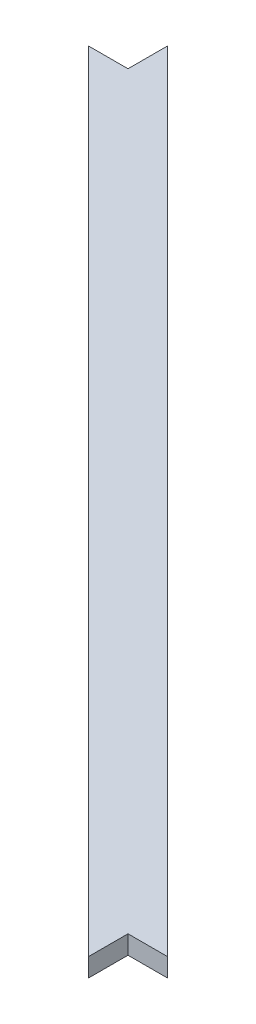
ISO-10303-21;
HEADER;
FILE_DESCRIPTION(('STEP AP214'),'2;1');
FILE_NAME('part.step','',(''),(''),'','','');
FILE_SCHEMA(('AUTOMOTIVE_DESIGN { 1 0 10303 214 1 1 1 1 }'));
ENDSEC;
DATA;
#1=APPLICATION_CONTEXT('core data for automotive mechanical design processes');
#2=APPLICATION_PROTOCOL_DEFINITION('international standard','automotive_design',2000,#1);
#3=PRODUCT_CONTEXT('',#1,'mechanical');
#4=PRODUCT('Part','Part','',(#3));
#5=PRODUCT_RELATED_PRODUCT_CATEGORY('part','',(#4));
#6=PRODUCT_DEFINITION_FORMATION('','',#4);
#7=PRODUCT_DEFINITION_CONTEXT('part definition',#1,'design');
#8=PRODUCT_DEFINITION('design','',#6,#7);
#9=PRODUCT_DEFINITION_SHAPE('','',#8);
#10=(LENGTH_UNIT() NAMED_UNIT(*) SI_UNIT(.MILLI.,.METRE.));
#11=(NAMED_UNIT(*) PLANE_ANGLE_UNIT() SI_UNIT($,.RADIAN.));
#12=(NAMED_UNIT(*) SI_UNIT($,.STERADIAN.) SOLID_ANGLE_UNIT());
#13=UNCERTAINTY_MEASURE_WITH_UNIT(LENGTH_MEASURE(1.E-05),#10,'distance_accuracy_value','');
#14=(GEOMETRIC_REPRESENTATION_CONTEXT(3) GLOBAL_UNCERTAINTY_ASSIGNED_CONTEXT((#13)) GLOBAL_UNIT_ASSIGNED_CONTEXT((#10,
#11,#12)) REPRESENTATION_CONTEXT('',''));
#15=CARTESIAN_POINT('',(0.,0.,0.));
#16=DIRECTION('',(0.,0.,1.));
#17=DIRECTION('',(1.,0.,0.));
#18=AXIS2_PLACEMENT_3D('',#15,#16,#17);
#19=CARTESIAN_POINT('',(-256.,12.7,-256.));
#20=DIRECTION('',(0.,0.,1.));
#21=DIRECTION('',(1.,0.,0.));
#22=AXIS2_PLACEMENT_3D('',#19,#20,#21);
#23=PLANE('',#22);
#24=DIRECTION('',(-1.,0.,0.));
#25=VECTOR('',#24,1.);
#26=CARTESIAN_POINT('',(-256.,0.,-256.));
#27=LINE('',#26,#25);
#28=CARTESIAN_POINT('',(-256.,0.,-256.));
#29=VERTEX_POINT('',#28);
#30=CARTESIAN_POINT('',(-282.940768363208,0.,-256.));
#31=VERTEX_POINT('',#30);
#32=EDGE_CURVE('E128',#29,#31,#27,.T.);
#33=ORIENTED_EDGE('',*,*,#32,.T.);
#34=DIRECTION('',(0.,-1.,0.));
#35=VECTOR('',#34,1.);
#36=CARTESIAN_POINT('',(-282.940768363208,12.7,-256.));
#37=LINE('',#36,#35);
#38=CARTESIAN_POINT('',(-282.940768363208,12.7,-256.));
#39=VERTEX_POINT('',#38);
#40=EDGE_CURVE('E11',#39,#31,#37,.T.);
#41=ORIENTED_EDGE('',*,*,#40,.F.);
#42=DIRECTION('',(-1.,0.,0.));
#43=VECTOR('',#42,1.);
#44=CARTESIAN_POINT('',(-256.,12.7,-256.));
#45=LINE('',#44,#43);
#46=CARTESIAN_POINT('',(-256.,12.7,-256.));
#47=VERTEX_POINT('',#46);
#48=EDGE_CURVE('E144',#47,#39,#45,.T.);
#49=ORIENTED_EDGE('',*,*,#48,.F.);
#50=DIRECTION('',(0.,-1.,0.));
#51=VECTOR('',#50,1.);
#52=CARTESIAN_POINT('',(-256.,12.7,-256.));
#53=LINE('',#52,#51);
#54=EDGE_CURVE('E124',#47,#29,#53,.T.);
#55=ORIENTED_EDGE('',*,*,#54,.T.);
#56=EDGE_LOOP('',(#33,#41,#49,#55));
#57=FACE_BOUND('',#56,.T.);
#58=ADVANCED_FACE('F39',(#57),#23,.F.);
#59=CARTESIAN_POINT('',(-282.940768363208,12.7,-256.));
#60=DIRECTION('',(0.707106781186548,0.,-0.707106781186548));
#61=DIRECTION('',(-0.707106781186548,0.,-0.707106781186548));
#62=AXIS2_PLACEMENT_3D('',#59,#60,#61);
#63=PLANE('',#62);
#64=DIRECTION('',(0.707106781186547,0.,0.707106781186547));
#65=VECTOR('',#64,1.);
#66=CARTESIAN_POINT('',(-282.940768363208,0.,-256.));
#67=LINE('',#66,#65);
#68=CARTESIAN_POINT('',(256.,0.,282.940768363208));
#69=VERTEX_POINT('',#68);
#70=EDGE_CURVE('E132',#31,#69,#67,.T.);
#71=ORIENTED_EDGE('',*,*,#70,.T.);
#72=DIRECTION('',(0.,-1.,0.));
#73=VECTOR('',#72,1.);
#74=CARTESIAN_POINT('',(256.,12.7,282.940768363208));
#75=LINE('',#74,#73);
#76=CARTESIAN_POINT('',(256.,12.7,282.940768363208));
#77=VERTEX_POINT('',#76);
#78=EDGE_CURVE('E48',#77,#69,#75,.T.);
#79=ORIENTED_EDGE('',*,*,#78,.F.);
#80=DIRECTION('',(0.707106781186547,0.,0.707106781186547));
#81=VECTOR('',#80,1.);
#82=CARTESIAN_POINT('',(-282.940768363208,12.7,-256.));
#83=LINE('',#82,#81);
#84=EDGE_CURVE('E93',#39,#77,#83,.T.);
#85=ORIENTED_EDGE('',*,*,#84,.F.);
#86=ORIENTED_EDGE('',*,*,#40,.T.);
#87=EDGE_LOOP('',(#71,#79,#85,#86));
#88=FACE_BOUND('',#87,.T.);
#89=ADVANCED_FACE('F172',(#88),#63,.F.);
#90=CARTESIAN_POINT('',(256.,12.7,282.940768363208));
#91=DIRECTION('',(-1.,0.,0.));
#92=DIRECTION('',(0.,0.,1.));
#93=AXIS2_PLACEMENT_3D('',#90,#91,#92);
#94=PLANE('',#93);
#95=DIRECTION('',(0.,0.,-1.));
#96=VECTOR('',#95,1.);
#97=CARTESIAN_POINT('',(256.,0.,282.940768363208));
#98=LINE('',#97,#96);
#99=CARTESIAN_POINT('',(256.,0.,256.));
#100=VERTEX_POINT('',#99);
#101=EDGE_CURVE('E135',#69,#100,#98,.T.);
#102=ORIENTED_EDGE('',*,*,#101,.T.);
#103=DIRECTION('',(0.,-1.,0.));
#104=VECTOR('',#103,1.);
#105=CARTESIAN_POINT('',(256.,12.7,256.));
#106=LINE('',#105,#104);
#107=CARTESIAN_POINT('',(256.,12.7,256.));
#108=VERTEX_POINT('',#107);
#109=EDGE_CURVE('E117',#108,#100,#106,.T.);
#110=ORIENTED_EDGE('',*,*,#109,.F.);
#111=DIRECTION('',(0.,0.,-1.));
#112=VECTOR('',#111,1.);
#113=CARTESIAN_POINT('',(256.,12.7,282.940768363208));
#114=LINE('',#113,#112);
#115=EDGE_CURVE('E106',#77,#108,#114,.T.);
#116=ORIENTED_EDGE('',*,*,#115,.F.);
#117=ORIENTED_EDGE('',*,*,#78,.T.);
#118=EDGE_LOOP('',(#102,#110,#116,#117));
#119=FACE_BOUND('',#118,.T.);
#120=ADVANCED_FACE('F154',(#119),#94,.F.);
#121=CARTESIAN_POINT('',(256.,12.7,256.));
#122=DIRECTION('',(0.,0.,-1.));
#123=DIRECTION('',(-1.,0.,0.));
#124=AXIS2_PLACEMENT_3D('',#121,#122,#123);
#125=PLANE('',#124);
#126=DIRECTION('',(1.,0.,0.));
#127=VECTOR('',#126,1.);
#128=CARTESIAN_POINT('',(256.,0.,256.));
#129=LINE('',#128,#127);
#130=CARTESIAN_POINT('',(282.940768363208,0.,256.));
#131=VERTEX_POINT('',#130);
#132=EDGE_CURVE('E115',#100,#131,#129,.T.);
#133=ORIENTED_EDGE('',*,*,#132,.T.);
#134=DIRECTION('',(0.,-1.,0.));
#135=VECTOR('',#134,1.);
#136=CARTESIAN_POINT('',(282.940768363208,12.7,256.));
#137=LINE('',#136,#135);
#138=CARTESIAN_POINT('',(282.940768363208,12.7,256.));
#139=VERTEX_POINT('',#138);
#140=EDGE_CURVE('E112',#139,#131,#137,.T.);
#141=ORIENTED_EDGE('',*,*,#140,.F.);
#142=DIRECTION('',(1.,0.,0.));
#143=VECTOR('',#142,1.);
#144=CARTESIAN_POINT('',(256.,12.7,256.));
#145=LINE('',#144,#143);
#146=EDGE_CURVE('E100',#108,#139,#145,.T.);
#147=ORIENTED_EDGE('',*,*,#146,.F.);
#148=ORIENTED_EDGE('',*,*,#109,.T.);
#149=EDGE_LOOP('',(#133,#141,#147,#148));
#150=FACE_BOUND('',#149,.T.);
#151=ADVANCED_FACE('F113',(#150),#125,.F.);
#152=CARTESIAN_POINT('',(282.940768363208,12.7,256.));
#153=DIRECTION('',(-0.707106781186547,0.,0.707106781186548));
#154=DIRECTION('',(0.707106781186548,0.,0.707106781186547));
#155=AXIS2_PLACEMENT_3D('',#152,#153,#154);
#156=PLANE('',#155);
#157=DIRECTION('',(-0.707106781186548,0.,-0.707106781186547));
#158=VECTOR('',#157,1.);
#159=CARTESIAN_POINT('',(282.940768363208,0.,256.));
#160=LINE('',#159,#158);
#161=CARTESIAN_POINT('',(-256.,0.,-282.940768363207));
#162=VERTEX_POINT('',#161);
#163=EDGE_CURVE('E79',#131,#162,#160,.T.);
#164=ORIENTED_EDGE('',*,*,#163,.T.);
#165=DIRECTION('',(0.,-1.,0.));
#166=VECTOR('',#165,1.);
#167=CARTESIAN_POINT('',(-256.,12.7,-282.940768363207));
#168=LINE('',#167,#166);
#169=CARTESIAN_POINT('',(-256.,12.7,-282.940768363207));
#170=VERTEX_POINT('',#169);
#171=EDGE_CURVE('E118',#170,#162,#168,.T.);
#172=ORIENTED_EDGE('',*,*,#171,.F.);
#173=DIRECTION('',(-0.707106781186548,0.,-0.707106781186547));
#174=VECTOR('',#173,1.);
#175=CARTESIAN_POINT('',(282.940768363208,12.7,256.));
#176=LINE('',#175,#174);
#177=EDGE_CURVE('E104',#139,#170,#176,.T.);
#178=ORIENTED_EDGE('',*,*,#177,.F.);
#179=ORIENTED_EDGE('',*,*,#140,.T.);
#180=EDGE_LOOP('',(#164,#172,#178,#179));
#181=FACE_BOUND('',#180,.T.);
#182=ADVANCED_FACE('F120',(#181),#156,.F.);
#183=CARTESIAN_POINT('',(-256.,12.7,-282.940768363207));
#184=DIRECTION('',(1.,0.,0.));
#185=DIRECTION('',(0.,0.,-1.));
#186=AXIS2_PLACEMENT_3D('',#183,#184,#185);
#187=PLANE('',#186);
#188=DIRECTION('',(0.,0.,1.));
#189=VECTOR('',#188,1.);
#190=CARTESIAN_POINT('',(-256.,0.,-282.940768363207));
#191=LINE('',#190,#189);
#192=EDGE_CURVE('E85',#162,#29,#191,.T.);
#193=ORIENTED_EDGE('',*,*,#192,.T.);
#194=ORIENTED_EDGE('',*,*,#54,.F.);
#195=DIRECTION('',(0.,0.,1.));
#196=VECTOR('',#195,1.);
#197=CARTESIAN_POINT('',(-256.,12.7,-282.940768363207));
#198=LINE('',#197,#196);
#199=EDGE_CURVE('E56',#170,#47,#198,.T.);
#200=ORIENTED_EDGE('',*,*,#199,.F.);
#201=ORIENTED_EDGE('',*,*,#171,.T.);
#202=EDGE_LOOP('',(#193,#194,#200,#201));
#203=FACE_BOUND('',#202,.T.);
#204=ADVANCED_FACE('F161',(#203),#187,.F.);
#205=CARTESIAN_POINT('',(0.,12.7,0.));
#206=DIRECTION('',(0.,-1.,0.));
#207=DIRECTION('',(0.,0.,-1.));
#208=AXIS2_PLACEMENT_3D('',#205,#206,#207);
#209=PLANE('',#208);
#210=ORIENTED_EDGE('',*,*,#48,.T.);
#211=ORIENTED_EDGE('',*,*,#84,.T.);
#212=ORIENTED_EDGE('',*,*,#115,.T.);
#213=ORIENTED_EDGE('',*,*,#146,.T.);
#214=ORIENTED_EDGE('',*,*,#177,.T.);
#215=ORIENTED_EDGE('',*,*,#199,.T.);
#216=EDGE_LOOP('',(#210,#211,#212,#213,#214,#215));
#217=FACE_BOUND('',#216,.T.);
#218=ADVANCED_FACE('F102',(#217),#209,.F.);
#219=CARTESIAN_POINT('',(0.,0.,0.));
#220=DIRECTION('',(0.,-1.,0.));
#221=DIRECTION('',(0.,0.,-1.));
#222=AXIS2_PLACEMENT_3D('',#219,#220,#221);
#223=PLANE('',#222);
#224=ORIENTED_EDGE('',*,*,#32,.F.);
#225=ORIENTED_EDGE('',*,*,#192,.F.);
#226=ORIENTED_EDGE('',*,*,#163,.F.);
#227=ORIENTED_EDGE('',*,*,#132,.F.);
#228=ORIENTED_EDGE('',*,*,#101,.F.);
#229=ORIENTED_EDGE('',*,*,#70,.F.);
#230=EDGE_LOOP('',(#224,#225,#226,#227,#228,#229));
#231=FACE_BOUND('',#230,.T.);
#232=ADVANCED_FACE('F157',(#231),#223,.T.);
#233=CLOSED_SHELL('',(#58,#89,#120,#151,#182,#204,#218,#232));
#234=MANIFOLD_SOLID_BREP('B2',#233);
#235=ADVANCED_BREP_SHAPE_REPRESENTATION('',(#18,#234),#14);
#236=SHAPE_DEFINITION_REPRESENTATION(#9,#235);
ENDSEC;
END-ISO-10303-21;
